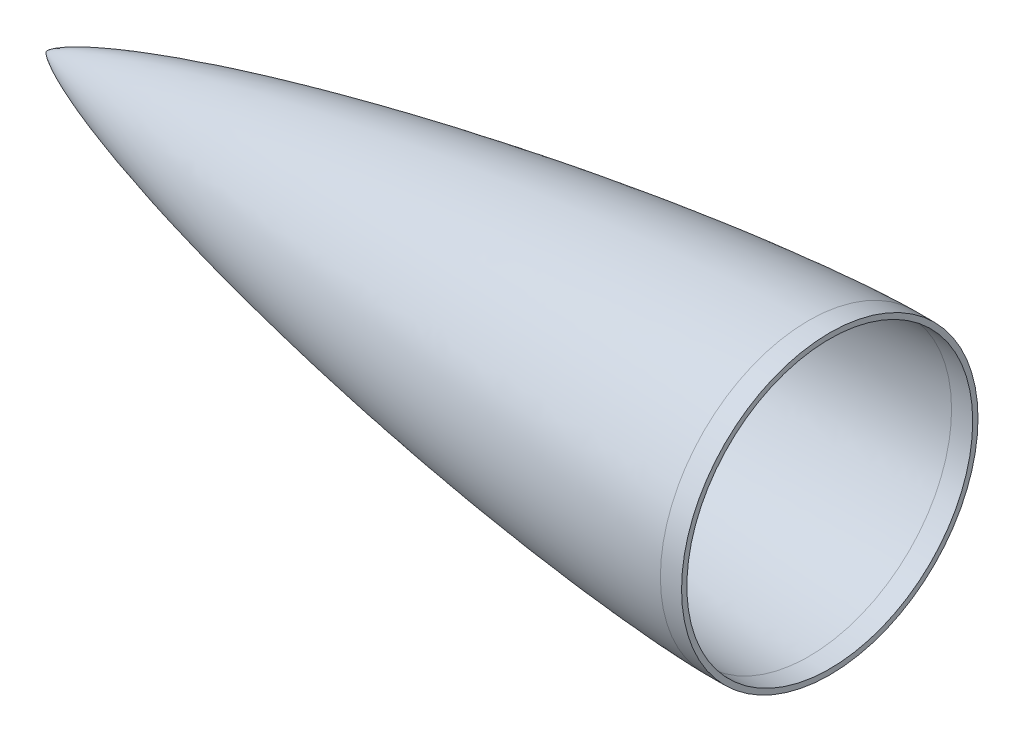
ISO-10303-21;
HEADER;
FILE_DESCRIPTION(('STEP AP214'),'2;1');
FILE_NAME('part.step','',(''),(''),'','','');
FILE_SCHEMA(('AUTOMOTIVE_DESIGN { 1 0 10303 214 1 1 1 1 }'));
ENDSEC;
DATA;
#1=APPLICATION_CONTEXT('core data for automotive mechanical design processes');
#2=APPLICATION_PROTOCOL_DEFINITION('international standard','automotive_design',2000,#1);
#3=PRODUCT_CONTEXT('',#1,'mechanical');
#4=PRODUCT('Part','Part','',(#3));
#5=PRODUCT_RELATED_PRODUCT_CATEGORY('part','',(#4));
#6=PRODUCT_DEFINITION_FORMATION('','',#4);
#7=PRODUCT_DEFINITION_CONTEXT('part definition',#1,'design');
#8=PRODUCT_DEFINITION('design','',#6,#7);
#9=PRODUCT_DEFINITION_SHAPE('','',#8);
#10=(LENGTH_UNIT() NAMED_UNIT(*) SI_UNIT(.MILLI.,.METRE.));
#11=(NAMED_UNIT(*) PLANE_ANGLE_UNIT() SI_UNIT($,.RADIAN.));
#12=(NAMED_UNIT(*) SI_UNIT($,.STERADIAN.) SOLID_ANGLE_UNIT());
#13=UNCERTAINTY_MEASURE_WITH_UNIT(LENGTH_MEASURE(1.E-05),#10,'distance_accuracy_value','');
#14=(GEOMETRIC_REPRESENTATION_CONTEXT(3) GLOBAL_UNCERTAINTY_ASSIGNED_CONTEXT((#13)) GLOBAL_UNIT_ASSIGNED_CONTEXT((#10,
#11,#12)) REPRESENTATION_CONTEXT('',''));
#15=CARTESIAN_POINT('',(0.,0.,0.));
#16=DIRECTION('',(0.,0.,1.));
#17=DIRECTION('',(1.,0.,0.));
#18=AXIS2_PLACEMENT_3D('',#15,#16,#17);
#19=CARTESIAN_POINT('',(457.2,88.8999999812199,0.));
#20=CARTESIAN_POINT('',(455.946335943503,88.8944606201357,0.));
#21=CARTESIAN_POINT('',(453.439289178273,88.851920429452,0.));
#22=CARTESIAN_POINT('',(448.426307527541,88.7186629849713,0.));
#23=CARTESIAN_POINT('',(439.738528716578,88.3707010309828,0.));
#24=CARTESIAN_POINT('',(428.633517350178,87.7744736606252,0.));
#25=CARTESIAN_POINT('',(411.445236253674,86.6180461994104,0.));
#26=CARTESIAN_POINT('',(389.441934274092,84.7796686074712,0.));
#27=CARTESIAN_POINT('',(363.809388761154,82.2199563699249,0.));
#28=CARTESIAN_POINT('',(334.567274000541,78.8147306663979,0.));
#29=CARTESIAN_POINT('',(305.378606257398,74.9796629030643,0.));
#30=CARTESIAN_POINT('',(276.245797951401,70.7416949570276,0.));
#31=CARTESIAN_POINT('',(247.172465418268,66.1133292320911,0.));
#32=CARTESIAN_POINT('',(218.163982111462,61.0945445774115,0.));
#33=CARTESIAN_POINT('',(189.22769389017,55.6742393089748,0.));
#34=CARTESIAN_POINT('',(160.374510852215,49.8272598482654,0.));
#35=CARTESIAN_POINT('',(131.619753694716,43.5119502410598,0.));
#36=CARTESIAN_POINT('',(102.988289697023,36.6578032492144,0.));
#37=CARTESIAN_POINT('',(75.2303655600253,29.3379492894826,0.));
#38=CARTESIAN_POINT('',(51.2291713731623,22.2418787836293,0.));
#39=CARTESIAN_POINT('',(32.1618165208626,15.8285715429721,0.));
#40=CARTESIAN_POINT('',(18.8825430752649,10.6591860004541,0.));
#41=CARTESIAN_POINT('',(11.1361591860583,7.19819098797093,0.));
#42=CARTESIAN_POINT('',(6.41591309691523,4.76827485369128,0.));
#43=CARTESIAN_POINT('',(3.70066989156161,3.15612963545332,0.));
#44=CARTESIAN_POINT('',(2.17142796707683,2.11554840534846,0.));
#45=CARTESIAN_POINT('',(1.2973929151981,1.43698462673741,0.));
#46=CARTESIAN_POINT('',(0.796743276301004,0.996314892163577,0.));
#47=CARTESIAN_POINT('',(0.508294818778763,0.709916230750631,0.));
#48=CARTESIAN_POINT('',(0.336980112024731,0.520691983575458,0.));
#49=CARTESIAN_POINT('',(0.21908320232472,0.377874192802509,0.));
#50=CARTESIAN_POINT('',(0.13389191901512,0.263104421235996,0.));
#51=CARTESIAN_POINT('',(0.0695158210369458,0.163009701552009,0.));
#52=CARTESIAN_POINT('',(0.0259240779059889,0.0786881702637964,0.));
#53=CARTESIAN_POINT('',(0.00817249777092053,0.0346015514793156,0.));
#54=CARTESIAN_POINT('',(0.00225232645332878,0.01167601452032,0.));
#55=CARTESIAN_POINT('',(0.,0.,0.));
#56=B_SPLINE_CURVE_WITH_KNOTS('',4,(#19,#20,#21,#22,#23,#24,#25,#26,#27,#28,#29,#30,#31,#32,#33,
#34,#35,#36,#37,#38,#39,#40,#41,#42,#43,#44,#45,#46,#47,#48,#49,#50,#51,#52,#53,#54,#55),
.UNSPECIFIED.,.F.,.F.,(5,1,1,1,1,1,1,1,1,1,1,1,1,1,1,1,1,1,1,1,1,1,1,1,1,1,1,1,1,1,1,1,1,5),(0.,
0.0107028585380353,0.0214057170760706,0.0428114341521413,0.0742270157325527,0.105642597312964,
0.168473764206997,0.231304931982375,0.294136098970658,0.356967264356424,0.419798428348863,
0.482629592968627,0.545460763247526,0.608291924199729,0.671123088292516,0.733954252259366,
0.796785426442417,0.859616579931013,0.916172283107633,0.947587760612356,0.968473522679314,
0.981230284831595,0.988574032279887,0.992887338626149,0.995416082705639,0.997012138676964,
0.998014751720399,0.998578022256532,0.998884309623599,0.999190596990666,0.999595298495333,
0.999797649247667,0.999898824623833,1.),.UNSPECIFIED.);
#57=CARTESIAN_POINT('',(457.2,0.,0.));
#58=DIRECTION('',(1.,0.,0.));
#59=AXIS1_PLACEMENT('',#57,#58);
#60=SURFACE_OF_REVOLUTION('',#56,#59);
#61=CARTESIAN_POINT('',(0.,0.,0.));
#62=VERTEX_POINT('',#61);
#63=VERTEX_LOOP('',#62);
#64=FACE_BOUND('',#63,.T.);
#65=CARTESIAN_POINT('',(457.2,0.,0.));
#66=DIRECTION('',(1.,0.,0.));
#67=DIRECTION('',(0.,0.,-1.));
#68=AXIS2_PLACEMENT_3D('',#65,#66,#67);
#69=CIRCLE('',#68,88.8999999812199);
#70=CARTESIAN_POINT('',(457.2,0.,-88.8999999812199));
#71=VERTEX_POINT('',#70);
#72=EDGE_CURVE('E43',#71,#71,#69,.T.);
#73=ORIENTED_EDGE('',*,*,#72,.F.);
#74=EDGE_LOOP('',(#73));
#75=FACE_BOUND('',#74,.T.);
#76=ADVANCED_FACE('F35',(#64,#75),#60,.F.);
#77=CARTESIAN_POINT('',(469.9,0.,0.));
#78=DIRECTION('',(1.,0.,0.));
#79=DIRECTION('',(0.,0.,-1.));
#80=AXIS2_PLACEMENT_3D('',#77,#78,#79);
#81=PLANE('',#80);
#82=CARTESIAN_POINT('',(469.9,0.,0.));
#83=DIRECTION('',(1.,0.,0.));
#84=DIRECTION('',(0.,0.,-1.));
#85=AXIS2_PLACEMENT_3D('',#82,#83,#84);
#86=CIRCLE('',#85,85.72499998122);
#87=CARTESIAN_POINT('',(469.9,0.,-85.72499998122));
#88=VERTEX_POINT('',#87);
#89=EDGE_CURVE('E61',#88,#88,#86,.T.);
#90=ORIENTED_EDGE('',*,*,#89,.F.);
#91=EDGE_LOOP('',(#90));
#92=FACE_BOUND('',#91,.T.);
#93=CARTESIAN_POINT('',(469.9,0.,0.));
#94=DIRECTION('',(1.,0.,0.));
#95=DIRECTION('',(0.,0.,-1.));
#96=AXIS2_PLACEMENT_3D('',#93,#94,#95);
#97=CIRCLE('',#96,88.8999999812201);
#98=CARTESIAN_POINT('',(469.9,0.,-88.8999999812201));
#99=VERTEX_POINT('',#98);
#100=EDGE_CURVE('E11',#99,#99,#97,.T.);
#101=ORIENTED_EDGE('',*,*,#100,.T.);
#102=EDGE_LOOP('',(#101));
#103=FACE_BOUND('',#102,.T.);
#104=ADVANCED_FACE('F85',(#92,#103),#81,.T.);
#105=CARTESIAN_POINT('',(457.2,0.,0.));
#106=DIRECTION('',(1.,0.,0.));
#107=DIRECTION('',(0.,0.,-1.));
#108=AXIS2_PLACEMENT_3D('',#105,#106,#107);
#109=CYLINDRICAL_SURFACE('',#108,88.89999998122);
#110=ORIENTED_EDGE('',*,*,#72,.T.);
#111=EDGE_LOOP('',(#110));
#112=FACE_BOUND('',#111,.T.);
#113=ORIENTED_EDGE('',*,*,#100,.F.);
#114=EDGE_LOOP('',(#113));
#115=FACE_BOUND('',#114,.T.);
#116=ADVANCED_FACE('F53',(#112,#115),#109,.T.);
#117=CARTESIAN_POINT('',(457.2,88.8999999812199,0.));
#118=CARTESIAN_POINT('',(455.946335943503,88.8944606201357,0.));
#119=CARTESIAN_POINT('',(453.439289178273,88.851920429452,0.));
#120=CARTESIAN_POINT('',(448.426307527541,88.7186629849713,0.));
#121=CARTESIAN_POINT('',(439.738528716578,88.3707010309828,0.));
#122=CARTESIAN_POINT('',(428.633517350178,87.7744736606252,0.));
#123=CARTESIAN_POINT('',(411.445236253674,86.6180461994104,0.));
#124=CARTESIAN_POINT('',(389.441934274092,84.7796686074712,0.));
#125=CARTESIAN_POINT('',(363.809388761154,82.2199563699249,0.));
#126=CARTESIAN_POINT('',(334.567274000541,78.8147306663979,0.));
#127=CARTESIAN_POINT('',(305.378606257398,74.9796629030643,0.));
#128=CARTESIAN_POINT('',(276.245797951401,70.7416949570276,0.));
#129=CARTESIAN_POINT('',(247.172465418268,66.1133292320911,0.));
#130=CARTESIAN_POINT('',(218.163982111462,61.0945445774115,0.));
#131=CARTESIAN_POINT('',(189.22769389017,55.6742393089748,0.));
#132=CARTESIAN_POINT('',(160.374510852215,49.8272598482654,0.));
#133=CARTESIAN_POINT('',(131.619753694716,43.5119502410598,0.));
#134=CARTESIAN_POINT('',(102.988289697023,36.6578032492144,0.));
#135=CARTESIAN_POINT('',(75.2303655600253,29.3379492894826,0.));
#136=CARTESIAN_POINT('',(51.2291713731623,22.2418787836293,0.));
#137=CARTESIAN_POINT('',(32.1618165208626,15.8285715429721,0.));
#138=CARTESIAN_POINT('',(18.8825430752649,10.6591860004541,0.));
#139=CARTESIAN_POINT('',(11.1361591860583,7.19819098797093,0.));
#140=CARTESIAN_POINT('',(6.5650147431595,4.84503027894123,0.));
#141=CARTESIAN_POINT('',(4.2442120622363,3.47816174224873,0.));
#142=CARTESIAN_POINT('',(3.23847281831269,2.82728122363293,0.));
#143=CARTESIAN_POINT('',(2.95777397128693,2.63966691182523,0.));
#144=B_SPLINE_CURVE_WITH_KNOTS('',4,(#117,#118,#119,#120,#121,#122,#123,#124,#125,#126,#127,
#128,#129,#130,#131,#132,#133,#134,#135,#136,#137,#138,#139,#140,#141,#142,#143),.UNSPECIFIED.,
.F.,.F.,(5,1,1,1,1,1,1,1,1,1,1,1,1,1,1,1,1,1,1,1,1,1,1,5),(0.,0.0107028585380353,
0.0214057170760706,0.0428114341521413,0.0742270157325527,0.105642597312964,0.168473764206997,
0.231304931982375,0.294136098970658,0.356967264356424,0.419798428348863,0.482629592968627,
0.545460763247526,0.608291924199729,0.671123088292516,0.733954252259366,0.796785426442417,
0.859616579931013,0.916172283107633,0.947587760612356,0.968473522679314,0.981230284831595,
0.988574032279887,0.991456429828499),.UNSPECIFIED.);
#145=CARTESIAN_POINT('',(457.2,0.,0.));
#146=DIRECTION('',(1.,0.,0.));
#147=AXIS1_PLACEMENT('',#145,#146);
#148=SURFACE_OF_REVOLUTION('',#144,#147);
#149=OFFSET_SURFACE('',#148,3.175,.F.);
#150=CARTESIAN_POINT('',(4.72208221947229,0.,0.));
#151=VERTEX_POINT('',#150);
#152=VERTEX_LOOP('',#151);
#153=FACE_BOUND('',#152,.T.);
#154=CARTESIAN_POINT('',(457.214028717924,0.,-85.725030974273));
#155=CARTESIAN_POINT('',(457.214028717913,1.40267395580041,-85.7250607284689));
#156=CARTESIAN_POINT('',(457.214028717908,2.80534537981036,-85.6906052698845));
#157=CARTESIAN_POINT('',(457.214028717904,5.60731042361656,-85.5529375704027));
#158=CARTESIAN_POINT('',(457.214028717905,7.00660404341304,-85.4497253295102));
#159=CARTESIAN_POINT('',(457.214028717911,9.79844073828855,-85.174757708667));
#160=CARTESIAN_POINT('',(457.214028717915,11.1909838133679,-85.0030023287196));
#161=CARTESIAN_POINT('',(457.214028717923,13.9659651215388,-84.5913715828189));
#162=CARTESIAN_POINT('',(457.214028717927,15.3484033546294,-84.3514962168594));
#163=CARTESIAN_POINT('',(457.214028717915,18.0998444404798,-83.8042008665199));
#164=CARTESIAN_POINT('',(457.2140287179,19.4688472932392,-83.4967808821379));
#165=CARTESIAN_POINT('',(457.214028717896,22.1901196035604,-82.815137570063));
#166=CARTESIAN_POINT('',(457.214028717907,23.5423890611237,-82.4409142423764));
#167=CARTESIAN_POINT('',(457.214028717924,26.2269368368447,-81.6265655999801));
#168=CARTESIAN_POINT('',(457.21402871793,27.559215155001,-81.186440285266));
#169=CARTESIAN_POINT('',(457.214028717927,30.2005710789385,-80.2413480176464));
#170=CARTESIAN_POINT('',(457.214028717917,31.5096486847212,-79.7363810647452));
#171=CARTESIAN_POINT('',(457.214028717931,34.1014495008353,-78.6628220173585));
#172=CARTESIAN_POINT('',(457.214028717955,35.3841727111648,-78.0942299228689));
#173=CARTESIAN_POINT('',(457.214028717969,37.9201745438215,-76.8947903839927));
#174=CARTESIAN_POINT('',(457.21402871796,39.1734531661501,-76.2639429396094));
#175=CARTESIAN_POINT('',(457.214028717929,41.6475465648881,-74.9415124667212));
#176=CARTESIAN_POINT('',(457.214028717907,42.8683613412966,-74.2499294382146));
#177=CARTESIAN_POINT('',(457.214028717902,45.2745859984918,-72.8076938814062));
#178=CARTESIAN_POINT('',(457.214028717919,46.4599958792769,-72.0570413531019));
#179=CARTESIAN_POINT('',(457.214028717945,48.7925549888833,-70.4984751843819));
#180=CARTESIAN_POINT('',(457.214028717954,49.9397042177062,-69.6905615439688));
#181=CARTESIAN_POINT('',(457.214028717953,52.1929784404422,-68.0194194857674));
#182=CARTESIAN_POINT('',(457.214028717944,53.2991034343564,-67.1561910679808));
#183=CARTESIAN_POINT('',(457.214028717929,55.4676644353445,-65.3764990478503));
#184=CARTESIAN_POINT('',(457.214028717923,56.5301004424171,-64.4600354455049));
#185=CARTESIAN_POINT('',(457.214028717921,58.6087239683163,-62.5760808973468));
#186=CARTESIAN_POINT('',(457.214028717924,59.6249114871416,-61.6085899515329));
#187=CARTESIAN_POINT('',(457.214028717916,61.6085899517178,-59.6249114869486));
#188=CARTESIAN_POINT('',(457.214028717904,62.5760808974715,-58.6087239681811));
#189=CARTESIAN_POINT('',(457.214028717908,64.4600354455913,-56.5301004423191));
#190=CARTESIAN_POINT('',(457.214028717924,65.3764990479545,-55.467664435222));
#191=CARTESIAN_POINT('',(457.214028717948,67.1561910680908,-53.2991034342179));
#192=CARTESIAN_POINT('',(457.214028717957,68.019419485867,-52.1929784403136));
#193=CARTESIAN_POINT('',(457.21402871795,69.6905615440788,-49.9397042175522));
#194=CARTESIAN_POINT('',(457.214028717934,70.4984751845106,-48.7925549886924));
#195=CARTESIAN_POINT('',(457.21402871793,72.0570413532434,-46.4599958790634));
#196=CARTESIAN_POINT('',(457.214028717942,72.8076938815445,-45.2745859982943));
#197=CARTESIAN_POINT('',(457.214028717948,74.2499294382694,-42.8683613411727));
#198=CARTESIAN_POINT('',(457.214028717943,74.9415124666979,-41.647546564823));
#199=CARTESIAN_POINT('',(457.214028717946,76.2639429396661,-39.1734531661529));
#200=CARTESIAN_POINT('',(457.214028717956,76.8947903842045,-37.9201745438319));
#201=CARTESIAN_POINT('',(457.214028717948,78.094229922657,-35.3841727111545));
#202=CARTESIAN_POINT('',(457.214028717932,78.6628220165678,-34.1014495007966));
#203=CARTESIAN_POINT('',(457.214028717917,79.736381065533,-31.5096486847667));
#204=CARTESIAN_POINT('',(457.214028717918,80.2413480205919,-30.2005710790967));
#205=CARTESIAN_POINT('',(457.214028717939,81.1864402823109,-27.5592151548694));
#206=CARTESIAN_POINT('',(457.214028717958,81.6265655889663,-26.2269368363105));
#207=CARTESIAN_POINT('',(457.214028717964,82.4409142533885,-23.5423890616648));
#208=CARTESIAN_POINT('',(457.214028717951,82.8151376111603,-22.1901196055794));
#209=CARTESIAN_POINT('',(457.21402871793,83.49678084104,-19.4688472912241));
#210=CARTESIAN_POINT('',(457.214028717923,83.8042007131419,-18.0998444329527));
#211=CARTESIAN_POINT('',(457.214028717918,84.3514963702189,-15.3484033622493));
#212=CARTESIAN_POINT('',(457.214028717921,84.5913721551993,-13.9659651498184));
#213=CARTESIAN_POINT('',(457.214028717918,85.0030017563044,-11.1909837853233));
#214=CARTESIAN_POINT('',(457.214028717912,85.174755572424,-9.79844063325827));
#215=CARTESIAN_POINT('',(457.214028717904,85.4497274657854,-7.00660414811633));
#216=CARTESIAN_POINT('',(457.214028717901,85.5529455430316,-5.60731081503981));
#217=CARTESIAN_POINT('',(457.214028717911,85.6905972972758,-2.80534498797557));
#218=CARTESIAN_POINT('',(457.214028717924,85.725030974273,-1.40267249398782));
#219=CARTESIAN_POINT('',(457.214028717924,85.725030974273,1.40267249407022));
#220=CARTESIAN_POINT('',(457.214028717911,85.6905972972717,2.8053449881405));
#221=CARTESIAN_POINT('',(457.214028717901,85.5529455430155,5.6073108152854));
#222=CARTESIAN_POINT('',(457.214028717904,85.4497274657654,7.00660414836026));
#223=CARTESIAN_POINT('',(457.214028717912,85.174755572404,9.79844063342081));
#224=CARTESIAN_POINT('',(457.214028717917,85.0030017562922,11.1909837854064));
#225=CARTESIAN_POINT('',(457.214028717923,84.5913721551988,13.9659651498213));
#226=CARTESIAN_POINT('',(457.214028717925,84.3514963702186,15.3484033622507));
#227=CARTESIAN_POINT('',(457.214028717911,83.8042007131419,18.0998444329527));
#228=CARTESIAN_POINT('',(457.214028717895,83.4967808410399,19.4688472912241));
#229=CARTESIAN_POINT('',(457.214028717895,82.8151376111601,22.1901196055794));
#230=CARTESIAN_POINT('',(457.214028717912,82.4409142533883,23.5423890616648));
#231=CARTESIAN_POINT('',(457.214028717926,81.6265655889702,26.2269368362972));
#232=CARTESIAN_POINT('',(457.214028717923,81.1864402823196,27.5592151548429));
#233=CARTESIAN_POINT('',(457.214028717934,80.2413480205967,30.2005710790855));
#234=CARTESIAN_POINT('',(457.214028717949,79.7363810655272,31.5096486847834));
#235=CARTESIAN_POINT('',(457.214028717969,78.6628220165552,34.1014495008254));
#236=CARTESIAN_POINT('',(457.214028717975,78.0942299226504,35.3841727111687));
#237=CARTESIAN_POINT('',(457.214028717949,76.8947903841734,37.9201745438975));
#238=CARTESIAN_POINT('',(457.214028717917,76.2639429396005,39.1734531662828));
#239=CARTESIAN_POINT('',(457.214028717889,74.9415124665925,41.647546565012));
#240=CARTESIAN_POINT('',(457.214028717893,74.2499294381619,42.8683613413583));
#241=CARTESIAN_POINT('',(457.214028717916,72.8076938814097,45.2745859985122));
#242=CARTESIAN_POINT('',(457.214028717936,72.0570413530815,46.459995879316));
#243=CARTESIAN_POINT('',(457.214028717928,70.4984751843787,48.7925549888797));
#244=CARTESIAN_POINT('',(457.2140287179,69.6905615440105,49.939704217644));
#245=CARTESIAN_POINT('',(457.214028717903,68.0194194858513,52.1929784403343));
#246=CARTESIAN_POINT('',(457.214028717934,67.1561910680586,53.299103434259));
#247=CARTESIAN_POINT('',(457.214028717938,65.3764990479381,55.4676644352401));
#248=CARTESIAN_POINT('',(457.214028717911,64.4600354456101,56.5301004422964));
#249=CARTESIAN_POINT('',(457.214028717901,62.5760808974706,58.6087239681842));
#250=CARTESIAN_POINT('',(457.214028717919,61.6085899516568,59.6249114870137));
#251=CARTESIAN_POINT('',(457.214028717921,59.6249114870569,61.6085899516136));
#252=CARTESIAN_POINT('',(457.214028717905,58.6087239682729,62.5760808973861));
#253=CARTESIAN_POINT('',(457.214028717907,56.5301004423698,64.4600354455476));
#254=CARTESIAN_POINT('',(457.214028717924,55.4676644352477,65.3764990479334));
#255=CARTESIAN_POINT('',(457.214028717948,53.2991034341987,67.1561910681065));
#256=CARTESIAN_POINT('',(457.214028717954,52.1929784402746,68.0194194858973));
#257=CARTESIAN_POINT('',(457.214028717953,49.9397042175119,69.6905615441072));
#258=CARTESIAN_POINT('',(457.214028717945,48.7925549886719,70.4984751845244));
#259=CARTESIAN_POINT('',(457.21402871792,46.45999587914,72.0570413531922));
#260=CARTESIAN_POINT('',(457.214028717902,45.27458599845,72.8076938814457));
#261=CARTESIAN_POINT('',(457.214028717907,42.868361341333,74.2499294381784));
#262=CARTESIAN_POINT('',(457.214028717928,41.6475465649042,74.9415124666544));
#263=CARTESIAN_POINT('',(457.214028717961,39.1734531661529,76.2639429396661));
#264=CARTESIAN_POINT('',(457.214028717972,37.920174543832,76.8947903842046));
#265=CARTESIAN_POINT('',(457.214028717952,35.3841727111688,78.0942299226502));
#266=CARTESIAN_POINT('',(457.214028717922,34.1014495008255,78.662822016555));
#267=CARTESIAN_POINT('',(457.214028717909,31.5096486847962,79.7363810655216));
#268=CARTESIAN_POINT('',(457.214028717927,30.2005710791116,80.2413480205866));
#269=CARTESIAN_POINT('',(457.214028717929,27.5592151548638,81.1864402823129));
#270=CARTESIAN_POINT('',(457.214028717913,26.2269368362992,81.6265655889698));
#271=CARTESIAN_POINT('',(457.214028717918,23.5423890615815,82.4409142534132));
#272=CARTESIAN_POINT('',(457.214028717938,22.190119605429,82.8151376112017));
#273=CARTESIAN_POINT('',(457.214028717943,19.4688472910777,83.4967808410729));
#274=CARTESIAN_POINT('',(457.214028717926,18.0998444328792,83.8042007131566));
#275=CARTESIAN_POINT('',(457.21402871791,15.3484033622524,84.3514963702183));
#276=CARTESIAN_POINT('',(457.214028717911,13.9659651498245,84.5913721551981));
#277=CARTESIAN_POINT('',(457.214028717929,11.1909837854097,85.0030017562918));
#278=CARTESIAN_POINT('',(457.214028717947,9.79844063342249,85.174755572404));
#279=CARTESIAN_POINT('',(457.214028717962,7.00660414827857,85.4497274657737));
#280=CARTESIAN_POINT('',(457.214028717959,5.60731081512148,85.5529455430279));
#281=CARTESIAN_POINT('',(457.214028717946,2.80534498797613,85.6905972972759));
#282=CARTESIAN_POINT('',(457.214028717937,1.40267249398802,85.7250309742731));
#283=CARTESIAN_POINT('',(457.214028717912,-1.40267249407057,85.725030974273));
#284=CARTESIAN_POINT('',(457.214028717896,-2.80534498814106,85.6905972972716));
#285=CARTESIAN_POINT('',(457.214028717916,-5.60731081520486,85.5529455430195));
#286=CARTESIAN_POINT('',(457.214028717952,-7.00660414819862,85.4497274657775));
#287=CARTESIAN_POINT('',(457.214028717958,-9.79844063326271,85.1747555724238));
#288=CARTESIAN_POINT('',(457.214028717928,-11.1909837853322,85.0030017563034));
#289=CARTESIAN_POINT('',(457.214028717911,-13.9659651498313,84.5913721551971));
#290=CARTESIAN_POINT('',(457.214028717924,-15.3484033622618,84.3514963702167));
#291=CARTESIAN_POINT('',(457.214028717912,-18.0998444329606,83.8042007131401));
#292=CARTESIAN_POINT('',(457.214028717887,-19.468847291228,83.4967808410389));
#293=CARTESIAN_POINT('',(457.214028717909,-22.1901196056443,82.8151376111439));
#294=CARTESIAN_POINT('',(457.214028717956,-23.5423890617939,82.4409142533527));
#295=CARTESIAN_POINT('',(457.214028717972,-26.2269368364311,81.6265655889264));
#296=CARTESIAN_POINT('',(457.214028717942,-27.5592151549192,81.1864402822928));
#297=CARTESIAN_POINT('',(457.214028717907,-30.2005710791702,80.2413480205659));
#298=CARTESIAN_POINT('',(457.214028717903,-31.5096486849321,79.7363810654694));
#299=CARTESIAN_POINT('',(457.214028717928,-34.1014495009486,78.6628220165));
#300=CARTESIAN_POINT('',(457.214028717958,-35.3841727112054,78.094229922632));
#301=CARTESIAN_POINT('',(457.214028717946,-37.9201745438661,76.8947903841892));
#302=CARTESIAN_POINT('',(457.214028717905,-39.1734531662673,76.2639429396088));
#303=CARTESIAN_POINT('',(457.214028717901,-41.6475465650308,74.9415124665825));
#304=CARTESIAN_POINT('',(457.214028717937,-42.8683613413954,74.2499294381411));
#305=CARTESIAN_POINT('',(457.214028717953,-45.2745859985089,72.8076938814106));
#306=CARTESIAN_POINT('',(457.214028717933,-46.4599958792561,72.0570413531188));
#307=CARTESIAN_POINT('',(457.214028717905,-48.7925549888455,70.4984751844041));
#308=CARTESIAN_POINT('',(457.214028717898,-49.9397042176877,69.6905615439811));
#309=CARTESIAN_POINT('',(457.214028717906,-52.1929784404422,68.0194194857683));
#310=CARTESIAN_POINT('',(457.214028717921,-53.2991034343564,67.156191067981));
#311=CARTESIAN_POINT('',(457.214028717921,-55.4676644353444,65.3764990478499));
#312=CARTESIAN_POINT('',(457.214028717906,-56.5301004424171,64.4600354455047));
#313=CARTESIAN_POINT('',(457.214028717906,-58.6087239682729,62.5760808973862));
#314=CARTESIAN_POINT('',(457.214028717921,-59.6249114870569,61.6085899516136));
#315=CARTESIAN_POINT('',(457.21402871792,-61.6085899516135,59.624911487057));
#316=CARTESIAN_POINT('',(457.214028717904,-62.5760808973861,58.608723968273));
#317=CARTESIAN_POINT('',(457.214028717908,-64.4600354455047,56.5301004424171));
#318=CARTESIAN_POINT('',(457.214028717928,-65.3764990478499,55.4676644353445));
#319=CARTESIAN_POINT('',(457.214028717944,-67.1561910680122,53.2991034343185));
#320=CARTESIAN_POINT('',(457.21402871794,-68.0194194858289,52.1929784403648));
#321=CARTESIAN_POINT('',(457.214028717939,-69.6905615440514,49.9397042175891));
#322=CARTESIAN_POINT('',(457.214028717941,-70.4984751844578,48.7925549887675));
#323=CARTESIAN_POINT('',(457.214028717923,-72.0570413531431,46.4599958792176));
#324=CARTESIAN_POINT('',(457.214028717903,-72.8076938814221,45.2745859984894));
#325=CARTESIAN_POINT('',(457.214028717906,-74.2499294381784,42.868361341333));
#326=CARTESIAN_POINT('',(457.214028717928,-74.9415124666544,41.6475465649041));
#327=CARTESIAN_POINT('',(457.214028717961,-76.2639429396662,39.1734531661528));
#328=CARTESIAN_POINT('',(457.214028717972,-76.8947903842046,37.9201745438319));
#329=CARTESIAN_POINT('',(457.214028717952,-78.0942299226176,35.3841727112378));
#330=CARTESIAN_POINT('',(457.214028717922,-78.6628220164932,34.101449500965));
#331=CARTESIAN_POINT('',(457.214028717909,-79.7363810654667,31.5096486849386));
#332=CARTESIAN_POINT('',(457.214028717928,-80.2413480205609,30.2005710791834));
#333=CARTESIAN_POINT('',(457.214028717929,-81.1864402823109,27.5592151548694));
#334=CARTESIAN_POINT('',(457.214028717912,-81.6265655889661,26.2269368363105));
#335=CARTESIAN_POINT('',(457.214028717919,-82.4409142534101,23.5423890615929));
#336=CARTESIAN_POINT('',(457.214028717942,-82.8151376112003,22.1901196054347));
#337=CARTESIAN_POINT('',(457.214028717945,-83.496780841073,19.4688472910776));
#338=CARTESIAN_POINT('',(457.214028717925,-83.8042007131566,18.0998444328791));
#339=CARTESIAN_POINT('',(457.214028717912,-84.3514963702345,15.3484033621707));
#340=CARTESIAN_POINT('',(457.214028717919,-84.5913721552267,13.9659651496603));
#341=CARTESIAN_POINT('',(457.214028717919,-85.0030017563241,11.190983785164));
#342=CARTESIAN_POINT('',(457.214028717912,-85.1747555724318,9.79844063317848));
#343=CARTESIAN_POINT('',(457.214028717905,-85.4497274657854,7.00660414811635));
#344=CARTESIAN_POINT('',(457.214028717904,-85.5529455430317,5.60731081503983));
#345=CARTESIAN_POINT('',(457.214028717908,-85.6905972972758,2.80534498797563));
#346=CARTESIAN_POINT('',(457.214028717912,-85.725030974273,1.40267249398792));
#347=CARTESIAN_POINT('',(457.214028717937,-85.7250309742731,-1.40267249398765));
#348=CARTESIAN_POINT('',(457.214028717958,-85.690597297276,-2.80534498797552));
#349=CARTESIAN_POINT('',(457.214028717948,-85.5529455430278,-5.60731081512189));
#350=CARTESIAN_POINT('',(457.214028717917,-85.4497274657734,-7.00660414828022));
#351=CARTESIAN_POINT('',(457.214028717899,-85.1747555724037,-9.79844063342287));
#352=CARTESIAN_POINT('',(457.214028717912,-85.003001756292,-11.1909837854075));
#353=CARTESIAN_POINT('',(457.214028717927,-84.5913721551869,-13.9659651499015));
#354=CARTESIAN_POINT('',(457.214028717928,-84.3514963701909,-15.3484033624105));
#355=CARTESIAN_POINT('',(457.214028717913,-83.804200713122,-18.0998444330322));
#356=CARTESIAN_POINT('',(457.214028717897,-83.4967808410553,-19.4688472911463));
#357=CARTESIAN_POINT('',(457.214028717893,-82.8151376111928,-22.1901196054649));
#358=CARTESIAN_POINT('',(457.214028717906,-82.4409142533895,-23.5423890616676));
#359=CARTESIAN_POINT('',(457.214028717925,-81.6265655889493,-26.2269368363593));
#360=CARTESIAN_POINT('',(457.214028717931,-81.1864402823164,-27.5592151548496));
#361=CARTESIAN_POINT('',(457.214028717926,-80.2413480205962,-30.2005710790891));
#362=CARTESIAN_POINT('',(457.214028717917,-79.7363810655065,-31.5096486848376));
#363=CARTESIAN_POINT('',(457.214028717914,-78.6628220165334,-34.1014495008728));
#364=CARTESIAN_POINT('',(457.214028717922,-78.0942299226526,-35.3841727111608));
#365=CARTESIAN_POINT('',(457.214028717917,-76.8947903841951,-37.920174543854));
#366=CARTESIAN_POINT('',(457.214028717906,-76.263942939614,-39.1734531662572));
#367=CARTESIAN_POINT('',(457.2140287179,-74.941512466586,-41.6475465650246));
#368=CARTESIAN_POINT('',(457.214028717906,-74.2499294381435,-42.8683613413911));
#369=CARTESIAN_POINT('',(457.214028717903,-72.8076938814104,-45.274585998509));
#370=CARTESIAN_POINT('',(457.214028717895,-72.057041353117,-46.4599958792587));
#371=CARTESIAN_POINT('',(457.214028717891,-70.4984751844393,-48.7925549887925));
#372=CARTESIAN_POINT('',(457.214028717897,-69.690561544058,-49.9397042175784));
#373=CARTESIAN_POINT('',(457.214028717907,-68.019419485838,-52.1929784403538));
#374=CARTESIAN_POINT('',(457.214028717913,-67.1561910679955,-53.2991034343405));
#375=CARTESIAN_POINT('',(457.21402871793,-65.3764990478427,-55.4676644353515));
#376=CARTESIAN_POINT('',(457.214028717941,-64.4600354455367,-56.5301004423794));
#377=CARTESIAN_POINT('',(457.214028717941,-62.5760808974755,-58.6087239681772));
#378=CARTESIAN_POINT('',(457.214028717929,-61.6085899517198,-59.6249114869467));
#379=CARTESIAN_POINT('',(457.214028717912,-59.6249114871592,-61.6085899515153));
#380=CARTESIAN_POINT('',(457.214028717906,-58.6087239683525,-62.5760808973123));
#381=CARTESIAN_POINT('',(457.214028717906,-56.5301004424721,-64.4600354454566));
#382=CARTESIAN_POINT('',(457.21402871791,-55.4676644353988,-65.3764990478041));
#383=CARTESIAN_POINT('',(457.214028717933,-53.2991034343215,-67.1561910680108));
#384=CARTESIAN_POINT('',(457.214028717951,-52.1929784403152,-68.0194194858672));
#385=CARTESIAN_POINT('',(457.214028717956,-49.9397042175385,-69.6905615440875));
#386=CARTESIAN_POINT('',(457.214028717944,-48.7925549887724,-70.4984751844572));
#387=CARTESIAN_POINT('',(457.21402871792,-46.459995879241,-72.0570413531247));
#388=CARTESIAN_POINT('',(457.21402871791,-45.2745859984725,-72.8076938814178));
#389=CARTESIAN_POINT('',(457.214028717899,-42.8683613413552,-74.2499294381795));
#390=CARTESIAN_POINT('',(457.214028717899,-41.647546565009,-74.9415124666526));
#391=CARTESIAN_POINT('',(457.214028717907,-39.1734531662548,-76.263942939557));
#392=CARTESIAN_POINT('',(457.214028717916,-37.9201745438439,-76.8947903839831));
#393=CARTESIAN_POINT('',(457.214028717923,-35.3841727111024,-78.094229922897));
#394=CARTESIAN_POINT('',(457.214028717922,-34.1014495007723,-78.6628220173858));
#395=CARTESIAN_POINT('',(457.214028717927,-31.5096486846628,-79.7363810647682));
#396=CARTESIAN_POINT('',(457.214028717932,-30.2005710788854,-80.2413480176663));
#397=CARTESIAN_POINT('',(457.214028717925,-27.5592151550134,-81.1864402852606));
#398=CARTESIAN_POINT('',(457.214028717912,-26.2269368369184,-81.6265655999553));
#399=CARTESIAN_POINT('',(457.214028717919,-23.5423890611823,-82.4409142423611));
#400=CARTESIAN_POINT('',(457.214028717939,-22.1901196035404,-82.81513757007));
#401=CARTESIAN_POINT('',(457.214028717942,-19.4688472931313,-83.4967808821634));
#402=CARTESIAN_POINT('',(457.214028717926,-18.0998444403634,-83.8042008665452));
#403=CARTESIAN_POINT('',(457.214028717915,-15.3484033546529,-84.3514962168526));
#404=CARTESIAN_POINT('',(457.214028717921,-13.9659651217122,-84.5913715827878));
#405=CARTESIAN_POINT('',(457.214028717919,-11.1909838136046,-85.00300232869));
#406=CARTESIAN_POINT('',(457.214028717912,-9.79844073843676,-85.1747577086514));
#407=CARTESIAN_POINT('',(457.214028717904,-7.00660404338001,-85.4497253295144));
#408=CARTESIAN_POINT('',(457.214028717903,-5.6073104234907,-85.5529375704125));
#409=CARTESIAN_POINT('',(457.214028717909,-2.80534537966438,-85.6906052698881));
#410=CARTESIAN_POINT('',(457.214028717915,-1.40267395572753,-85.725060728469));
#411=CARTESIAN_POINT('',(457.214028717924,-2.17797228220982E-13,-85.725030974273));
#412=B_SPLINE_CURVE_WITH_KNOTS('',3,(#154,#155,#156,#157,#158,#159,#160,#161,#162,#163,#164,
#165,#166,#167,#168,#169,#170,#171,#172,#173,#174,#175,#176,#177,#178,#179,#180,#181,#182,#183,
#184,#185,#186,#187,#188,#189,#190,#191,#192,#193,#194,#195,#196,#197,#198,#199,#200,#201,#202,
#203,#204,#205,#206,#207,#208,#209,#210,#211,#212,#213,#214,#215,#216,#217,#218,#219,#220,#221,
#222,#223,#224,#225,#226,#227,#228,#229,#230,#231,#232,#233,#234,#235,#236,#237,#238,#239,#240,
#241,#242,#243,#244,#245,#246,#247,#248,#249,#250,#251,#252,#253,#254,#255,#256,#257,#258,#259,
#260,#261,#262,#263,#264,#265,#266,#267,#268,#269,#270,#271,#272,#273,#274,#275,#276,#277,#278,
#279,#280,#281,#282,#283,#284,#285,#286,#287,#288,#289,#290,#291,#292,#293,#294,#295,#296,#297,
#298,#299,#300,#301,#302,#303,#304,#305,#306,#307,#308,#309,#310,#311,#312,#313,#314,#315,#316,
#317,#318,#319,#320,#321,#322,#323,#324,#325,#326,#327,#328,#329,#330,#331,#332,#333,#334,#335,
#336,#337,#338,#339,#340,#341,#342,#343,#344,#345,#346,#347,#348,#349,#350,#351,#352,#353,#354,
#355,#356,#357,#358,#359,#360,#361,#362,#363,#364,#365,#366,#367,#368,#369,#370,#371,#372,#373,
#374,#375,#376,#377,#378,#379,#380,#381,#382,#383,#384,#385,#386,#387,#388,#389,#390,#391,#392,
#393,#394,#395,#396,#397,#398,#399,#400,#401,#402,#403,#404,#405,#406,#407,#408,#409,#410,#411),
.UNSPECIFIED.,.F.,.F.,(4,2,2,2,2,2,2,2,2,2,2,2,2,2,2,2,2,2,2,2,2,2,2,2,2,2,2,2,2,2,2,2,2,2,2,2,
2,2,2,2,2,2,2,2,2,2,2,2,2,2,2,2,2,2,2,2,2,2,2,2,2,2,2,2,2,2,2,2,2,2,2,2,2,2,2,2,2,2,2,2,2,2,2,2,
2,2,2,2,2,2,2,2,2,2,2,2,2,2,2,2,2,2,2,2,2,2,2,2,2,2,2,2,2,2,2,2,2,2,2,2,2,2,2,2,2,2,2,2,4),(0.,
4.20759515075596,8.41519030121769,12.622785451474,16.8303806021073,21.0379757528588,
25.2455709032191,29.4531660538758,33.6607612042623,37.8683563549277,42.0759515053779,
46.2835466559516,50.4911418067015,54.6987369572613,58.9063321077008,63.1139272582583,
67.321522408923,71.5291175593378,75.7367127099861,79.9443078603816,84.1519030110689,
88.3594981617564,92.5670933121177,96.7746884625678,100.982283613233,105.189878763599,
109.397473914276,113.605069064637,117.812664215376,122.020259365786,126.227854516521,
130.435449666988,134.643044817496,138.850639968251,143.058235118713,147.26583026921,
151.473425419615,155.681020570354,159.888615720715,164.096210871351,168.303806021805,
172.511401172423,176.718996323092,180.926591473447,185.134186624266,189.341781774609,
193.549376925083,197.75697207557,201.964567226243,206.172162376733,210.379757527482,
214.587352677951,218.794947828564,223.002542978976,227.210138129613,231.417733280063,
235.625328430681,239.832923581094,244.04051873179,248.248113882357,252.455709032872,
256.663304183272,260.870899333773,265.078494484483,269.286089634991,273.493684785747,
277.701279935966,281.908875086715,286.116470237123,290.32406538785,294.531660538411,
298.739255688867,302.94685083953,307.154445989866,311.362041140587,315.569636291007,
319.777231441624,323.984826592253,328.192421742692,332.400016893249,336.607612043739,
340.815207194229,345.022802344786,349.230397495373,353.437992645922,357.645587796471,
361.853182947109,366.060778097559,370.268373247948,374.47596839859,378.683563549268,
382.891158699853,387.098753850368,391.306349001017,395.513944151512,399.721539301979,
403.929134452487,408.136729602995,412.344324753707,416.551919904201,420.759515054849,
424.967110205105,429.17470535583,433.382300506291,437.589895656909,441.797490807346,
446.005085958074,450.2126811085,454.420276259126,458.627871409545,462.835466560257,
467.043061710636,471.25065686106,475.458252011649,479.665847162212,483.873442312998,
488.081037463344,492.288632614033,496.496227764395,500.703822915123,504.911418065789,
509.119013216157,513.326608366621,517.534203517226,521.741798668003,525.949393818181,
530.156988968705,534.364584119446,538.572179269982),.UNSPECIFIED.);
#413=CARTESIAN_POINT('',(457.214028717924,0.,-85.725030974273));
#414=VERTEX_POINT('',#413);
#415=EDGE_CURVE('E57',#414,#414,#412,.T.);
#416=ORIENTED_EDGE('',*,*,#415,.T.);
#417=EDGE_LOOP('',(#416));
#418=FACE_BOUND('',#417,.T.);
#419=ADVANCED_FACE('F49',(#153,#418),#149,.T.);
#420=CARTESIAN_POINT('',(457.2,0.,0.));
#421=DIRECTION('',(1.,0.,0.));
#422=DIRECTION('',(0.,0.,-1.));
#423=AXIS2_PLACEMENT_3D('',#420,#421,#422);
#424=CYLINDRICAL_SURFACE('',#423,85.72499998122);
#425=ORIENTED_EDGE('',*,*,#415,.F.);
#426=EDGE_LOOP('',(#425));
#427=FACE_BOUND('',#426,.T.);
#428=ORIENTED_EDGE('',*,*,#89,.T.);
#429=EDGE_LOOP('',(#428));
#430=FACE_BOUND('',#429,.T.);
#431=ADVANCED_FACE('F52',(#427,#430),#424,.F.);
#432=CLOSED_SHELL('',(#76,#104,#116,#419,#431));
#433=MANIFOLD_SOLID_BREP('B2',#432);
#434=ADVANCED_BREP_SHAPE_REPRESENTATION('',(#18,#433),#14);
#435=SHAPE_DEFINITION_REPRESENTATION(#9,#434);
ENDSEC;
END-ISO-10303-21;
